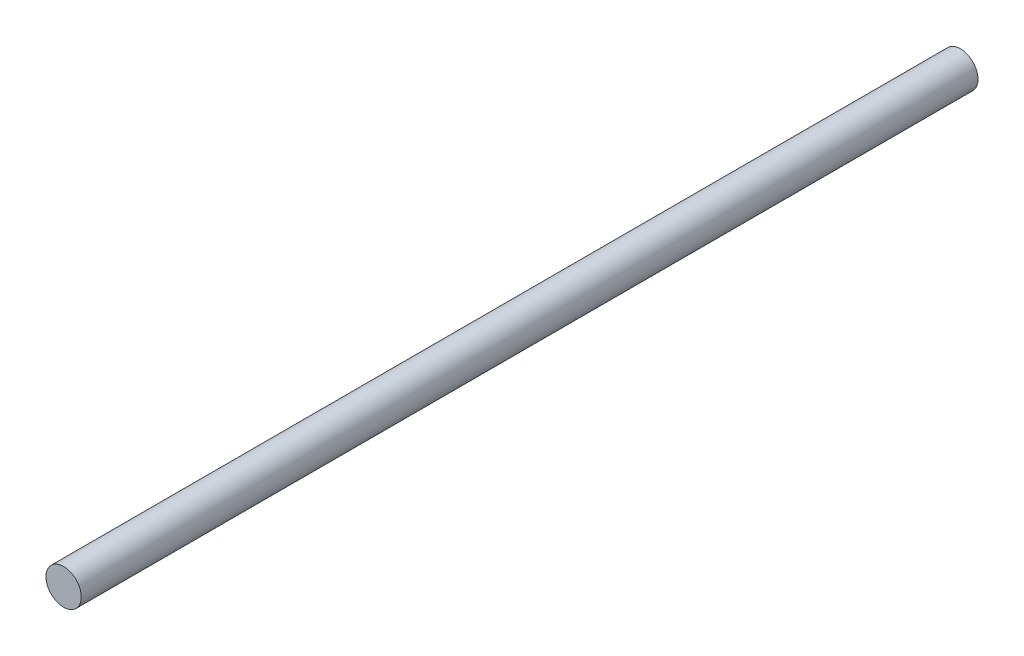
ISO-10303-21;
HEADER;
FILE_DESCRIPTION(('STEP AP214'),'2;1');
FILE_NAME('part.step','',(''),(''),'','','');
FILE_SCHEMA(('AUTOMOTIVE_DESIGN { 1 0 10303 214 1 1 1 1 }'));
ENDSEC;
DATA;
#1=APPLICATION_CONTEXT('core data for automotive mechanical design processes');
#2=APPLICATION_PROTOCOL_DEFINITION('international standard','automotive_design',2000,#1);
#3=PRODUCT_CONTEXT('',#1,'mechanical');
#4=PRODUCT('Part','Part','',(#3));
#5=PRODUCT_RELATED_PRODUCT_CATEGORY('part','',(#4));
#6=PRODUCT_DEFINITION_FORMATION('','',#4);
#7=PRODUCT_DEFINITION_CONTEXT('part definition',#1,'design');
#8=PRODUCT_DEFINITION('design','',#6,#7);
#9=PRODUCT_DEFINITION_SHAPE('','',#8);
#10=(LENGTH_UNIT() NAMED_UNIT(*) SI_UNIT(.MILLI.,.METRE.));
#11=(NAMED_UNIT(*) PLANE_ANGLE_UNIT() SI_UNIT($,.RADIAN.));
#12=(NAMED_UNIT(*) SI_UNIT($,.STERADIAN.) SOLID_ANGLE_UNIT());
#13=UNCERTAINTY_MEASURE_WITH_UNIT(LENGTH_MEASURE(1.E-05),#10,'distance_accuracy_value','');
#14=(GEOMETRIC_REPRESENTATION_CONTEXT(3) GLOBAL_UNCERTAINTY_ASSIGNED_CONTEXT((#13)) GLOBAL_UNIT_ASSIGNED_CONTEXT((#10,
#11,#12)) REPRESENTATION_CONTEXT('',''));
#15=CARTESIAN_POINT('',(0.,0.,0.));
#16=DIRECTION('',(0.,0.,1.));
#17=DIRECTION('',(1.,0.,0.));
#18=AXIS2_PLACEMENT_3D('',#15,#16,#17);
#19=CARTESIAN_POINT('',(-0.914484114258934,1.27356741573034,127.));
#20=DIRECTION('',(0.,0.,-1.));
#21=DIRECTION('',(-1.,0.,0.));
#22=AXIS2_PLACEMENT_3D('',#19,#20,#21);
#23=CYLINDRICAL_SURFACE('',#22,2.5);
#24=CARTESIAN_POINT('',(-0.914484114258934,1.27356741573034,127.));
#25=DIRECTION('',(0.,0.,1.));
#26=DIRECTION('',(1.,0.,0.));
#27=AXIS2_PLACEMENT_3D('',#24,#25,#26);
#28=CIRCLE('',#27,2.5);
#29=CARTESIAN_POINT('',(1.58551588574107,1.27356741573034,127.));
#30=VERTEX_POINT('',#29);
#31=EDGE_CURVE('E10',#30,#30,#28,.T.);
#32=ORIENTED_EDGE('',*,*,#31,.F.);
#33=EDGE_LOOP('',(#32));
#34=FACE_BOUND('',#33,.T.);
#35=CARTESIAN_POINT('',(-0.914484114258934,1.27356741573034,0.));
#36=DIRECTION('',(0.,0.,1.));
#37=DIRECTION('',(1.,0.,0.));
#38=AXIS2_PLACEMENT_3D('',#35,#36,#37);
#39=CIRCLE('',#38,2.5);
#40=CARTESIAN_POINT('',(1.58551588574107,1.27356741573034,0.));
#41=VERTEX_POINT('',#40);
#42=EDGE_CURVE('E37',#41,#41,#39,.T.);
#43=ORIENTED_EDGE('',*,*,#42,.T.);
#44=EDGE_LOOP('',(#43));
#45=FACE_BOUND('',#44,.T.);
#46=ADVANCED_FACE('F34',(#34,#45),#23,.T.);
#47=CARTESIAN_POINT('',(-0.914484114258934,1.27356741573034,127.));
#48=DIRECTION('',(0.,0.,1.));
#49=DIRECTION('',(1.,0.,0.));
#50=AXIS2_PLACEMENT_3D('',#47,#48,#49);
#51=PLANE('',#50);
#52=ORIENTED_EDGE('',*,*,#31,.T.);
#53=EDGE_LOOP('',(#52));
#54=FACE_BOUND('',#53,.T.);
#55=ADVANCED_FACE('F49',(#54),#51,.T.);
#56=CARTESIAN_POINT('',(-0.914484114258934,1.27356741573034,0.));
#57=DIRECTION('',(0.,0.,1.));
#58=DIRECTION('',(1.,0.,0.));
#59=AXIS2_PLACEMENT_3D('',#56,#57,#58);
#60=PLANE('',#59);
#61=ORIENTED_EDGE('',*,*,#42,.F.);
#62=EDGE_LOOP('',(#61));
#63=FACE_BOUND('',#62,.T.);
#64=ADVANCED_FACE('F47',(#63),#60,.F.);
#65=CLOSED_SHELL('',(#46,#55,#64));
#66=MANIFOLD_SOLID_BREP('B2',#65);
#67=ADVANCED_BREP_SHAPE_REPRESENTATION('',(#18,#66),#14);
#68=SHAPE_DEFINITION_REPRESENTATION(#9,#67);
ENDSEC;
END-ISO-10303-21;
